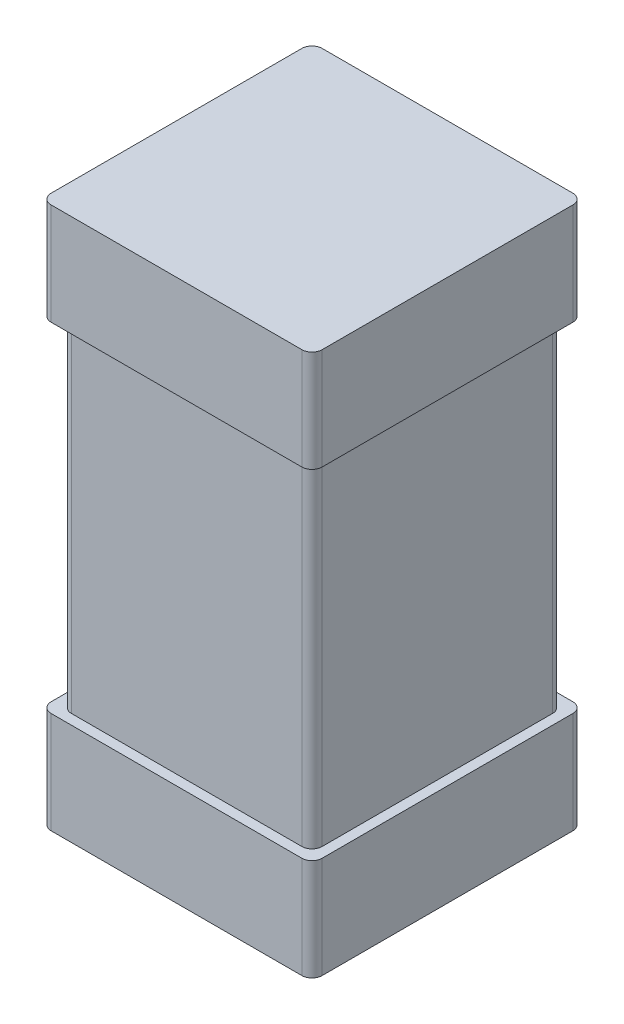
ISO-10303-21;
HEADER;
FILE_DESCRIPTION(('STEP AP214'),'2;1');
FILE_NAME('part.step','',(''),(''),'','','');
FILE_SCHEMA(('AUTOMOTIVE_DESIGN { 1 0 10303 214 1 1 1 1 }'));
ENDSEC;
DATA;
#1=APPLICATION_CONTEXT('core data for automotive mechanical design processes');
#2=APPLICATION_PROTOCOL_DEFINITION('international standard','automotive_design',2000,#1);
#3=PRODUCT_CONTEXT('',#1,'mechanical');
#4=PRODUCT('Part','Part','',(#3));
#5=PRODUCT_RELATED_PRODUCT_CATEGORY('part','',(#4));
#6=PRODUCT_DEFINITION_FORMATION('','',#4);
#7=PRODUCT_DEFINITION_CONTEXT('part definition',#1,'design');
#8=PRODUCT_DEFINITION('design','',#6,#7);
#9=PRODUCT_DEFINITION_SHAPE('','',#8);
#10=(LENGTH_UNIT() NAMED_UNIT(*) SI_UNIT(.MILLI.,.METRE.));
#11=(NAMED_UNIT(*) PLANE_ANGLE_UNIT() SI_UNIT($,.RADIAN.));
#12=(NAMED_UNIT(*) SI_UNIT($,.STERADIAN.) SOLID_ANGLE_UNIT());
#13=UNCERTAINTY_MEASURE_WITH_UNIT(LENGTH_MEASURE(1.E-05),#10,'distance_accuracy_value','');
#14=(GEOMETRIC_REPRESENTATION_CONTEXT(3) GLOBAL_UNCERTAINTY_ASSIGNED_CONTEXT((#13)) GLOBAL_UNIT_ASSIGNED_CONTEXT((#10,
#11,#12)) REPRESENTATION_CONTEXT('',''));
#15=CARTESIAN_POINT('',(0.,0.,0.));
#16=DIRECTION('',(0.,0.,1.));
#17=DIRECTION('',(1.,0.,0.));
#18=AXIS2_PLACEMENT_3D('',#15,#16,#17);
#19=CARTESIAN_POINT('',(139.070744279938,97.6120432923501,142.211582908599));
#20=DIRECTION('',(0.,1.,0.));
#21=DIRECTION('',(1.,0.,0.));
#22=AXIS2_PLACEMENT_3D('',#19,#20,#21);
#23=PLANE('',#22);
#24=DIRECTION('',(0.,0.,1.));
#25=VECTOR('',#24,1.);
#26=CARTESIAN_POINT('',(139.070744279938,97.6120432923501,142.211582908599));
#27=LINE('',#26,#25);
#28=CARTESIAN_POINT('',(139.070744279938,97.6120432923501,142.241582908599));
#29=VERTEX_POINT('',#28);
#30=CARTESIAN_POINT('',(139.070744279938,97.6120432923501,142.981582908599));
#31=VERTEX_POINT('',#30);
#32=EDGE_CURVE('E67',#29,#31,#27,.T.);
#33=ORIENTED_EDGE('',*,*,#32,.F.);
#34=CARTESIAN_POINT('',(139.040744279938,97.6120432923501,142.241582908599));
#35=DIRECTION('',(0.,1.,0.));
#36=DIRECTION('',(0.,0.,1.));
#37=AXIS2_PLACEMENT_3D('',#34,#35,#36);
#38=CIRCLE('',#37,0.0300000000000023);
#39=CARTESIAN_POINT('',(139.040744279938,97.6120432923501,142.211582908599));
#40=VERTEX_POINT('',#39);
#41=EDGE_CURVE('E11',#29,#40,#38,.T.);
#42=ORIENTED_EDGE('',*,*,#41,.T.);
#43=DIRECTION('',(-1.,0.,0.));
#44=VECTOR('',#43,1.);
#45=CARTESIAN_POINT('',(139.070744279938,97.6120432923501,142.211582908599));
#46=LINE('',#45,#44);
#47=CARTESIAN_POINT('',(138.300744279938,97.6120432923501,142.211582908599));
#48=VERTEX_POINT('',#47);
#49=EDGE_CURVE('E55',#40,#48,#46,.T.);
#50=ORIENTED_EDGE('',*,*,#49,.T.);
#51=CARTESIAN_POINT('',(138.300744279938,97.6120432923501,142.241582908599));
#52=DIRECTION('',(0.,-1.,0.));
#53=DIRECTION('',(0.,0.,1.));
#54=AXIS2_PLACEMENT_3D('',#51,#52,#53);
#55=CIRCLE('',#54,0.0300000000000023);
#56=CARTESIAN_POINT('',(138.270744279938,97.6120432923501,142.241582908599));
#57=VERTEX_POINT('',#56);
#58=EDGE_CURVE('E346',#57,#48,#55,.T.);
#59=ORIENTED_EDGE('',*,*,#58,.F.);
#60=DIRECTION('',(0.,0.,1.));
#61=VECTOR('',#60,1.);
#62=CARTESIAN_POINT('',(138.270744279938,97.6120432923501,142.211582908599));
#63=LINE('',#62,#61);
#64=CARTESIAN_POINT('',(138.270744279938,97.6120432923501,142.981582908599));
#65=VERTEX_POINT('',#64);
#66=EDGE_CURVE('E280',#57,#65,#63,.T.);
#67=ORIENTED_EDGE('',*,*,#66,.T.);
#68=CARTESIAN_POINT('',(138.300744279938,97.6120432923501,142.981582908599));
#69=DIRECTION('',(0.,1.,0.));
#70=DIRECTION('',(0.,0.,1.));
#71=AXIS2_PLACEMENT_3D('',#68,#69,#70);
#72=CIRCLE('',#71,0.0300000000000023);
#73=CARTESIAN_POINT('',(138.300744279938,97.6120432923501,143.011582908599));
#74=VERTEX_POINT('',#73);
#75=EDGE_CURVE('E302',#65,#74,#72,.T.);
#76=ORIENTED_EDGE('',*,*,#75,.T.);
#77=DIRECTION('',(-1.,0.,0.));
#78=VECTOR('',#77,1.);
#79=CARTESIAN_POINT('',(139.070744279938,97.6120432923501,143.011582908599));
#80=LINE('',#79,#78);
#81=CARTESIAN_POINT('',(139.040744279938,97.6120432923501,143.011582908599));
#82=VERTEX_POINT('',#81);
#83=EDGE_CURVE('E238',#82,#74,#80,.T.);
#84=ORIENTED_EDGE('',*,*,#83,.F.);
#85=CARTESIAN_POINT('',(139.040744279938,97.6120432923501,142.981582908599));
#86=DIRECTION('',(0.,-1.,0.));
#87=DIRECTION('',(0.,0.,1.));
#88=AXIS2_PLACEMENT_3D('',#85,#86,#87);
#89=CIRCLE('',#88,0.0300000000000023);
#90=EDGE_CURVE('E259',#31,#82,#89,.T.);
#91=ORIENTED_EDGE('',*,*,#90,.F.);
#92=EDGE_LOOP('',(#33,#42,#50,#59,#67,#76,#84,#91));
#93=FACE_BOUND('',#92,.T.);
#94=ADVANCED_FACE('F44',(#93),#23,.T.);
#95=CARTESIAN_POINT('',(138.270744279938,97.3120432923501,142.211582908599));
#96=DIRECTION('',(-1.,0.,0.));
#97=DIRECTION('',(0.,0.,1.));
#98=AXIS2_PLACEMENT_3D('',#95,#96,#97);
#99=PLANE('',#98);
#100=ORIENTED_EDGE('',*,*,#66,.F.);
#101=DIRECTION('',(0.,1.,0.));
#102=VECTOR('',#101,1.);
#103=CARTESIAN_POINT('',(138.270744279938,97.3120432923501,142.241582908599));
#104=LINE('',#103,#102);
#105=CARTESIAN_POINT('',(138.270744279938,97.3120432923501,142.241582908599));
#106=VERTEX_POINT('',#105);
#107=EDGE_CURVE('E231',#106,#57,#104,.T.);
#108=ORIENTED_EDGE('',*,*,#107,.F.);
#109=DIRECTION('',(0.,0.,1.));
#110=VECTOR('',#109,1.);
#111=CARTESIAN_POINT('',(138.270744279938,97.3120432923501,142.211582908599));
#112=LINE('',#111,#110);
#113=CARTESIAN_POINT('',(138.270744279938,97.3120432923501,142.981582908599));
#114=VERTEX_POINT('',#113);
#115=EDGE_CURVE('E306',#106,#114,#112,.T.);
#116=ORIENTED_EDGE('',*,*,#115,.T.);
#117=DIRECTION('',(0.,1.,0.));
#118=VECTOR('',#117,1.);
#119=CARTESIAN_POINT('',(138.270744279938,97.3120432923501,142.981582908599));
#120=LINE('',#119,#118);
#121=EDGE_CURVE('E285',#114,#65,#120,.T.);
#122=ORIENTED_EDGE('',*,*,#121,.T.);
#123=EDGE_LOOP('',(#100,#108,#116,#122));
#124=FACE_BOUND('',#123,.T.);
#125=ADVANCED_FACE('F618',(#124),#99,.T.);
#126=CARTESIAN_POINT('',(138.300744279938,97.3120432923501,142.981582908599));
#127=DIRECTION('',(0.,1.,0.));
#128=DIRECTION('',(-1.,0.,0.));
#129=AXIS2_PLACEMENT_3D('',#126,#127,#128);
#130=CYLINDRICAL_SURFACE('',#129,0.0300000000000023);
#131=CARTESIAN_POINT('',(138.300744279938,97.3120432923501,142.981582908599));
#132=DIRECTION('',(0.,1.,0.));
#133=DIRECTION('',(0.,0.,1.));
#134=AXIS2_PLACEMENT_3D('',#131,#132,#133);
#135=CIRCLE('',#134,0.0300000000000023);
#136=CARTESIAN_POINT('',(138.300744279938,97.3120432923501,143.011582908599));
#137=VERTEX_POINT('',#136);
#138=EDGE_CURVE('E281',#114,#137,#135,.T.);
#139=ORIENTED_EDGE('',*,*,#138,.T.);
#140=DIRECTION('',(0.,1.,0.));
#141=VECTOR('',#140,1.);
#142=CARTESIAN_POINT('',(138.300744279938,97.3120432923501,143.011582908599));
#143=LINE('',#142,#141);
#144=EDGE_CURVE('E286',#137,#74,#143,.T.);
#145=ORIENTED_EDGE('',*,*,#144,.T.);
#146=ORIENTED_EDGE('',*,*,#75,.F.);
#147=ORIENTED_EDGE('',*,*,#121,.F.);
#148=EDGE_LOOP('',(#139,#145,#146,#147));
#149=FACE_BOUND('',#148,.T.);
#150=ADVANCED_FACE('F533',(#149),#130,.T.);
#151=CARTESIAN_POINT('',(138.300744279938,97.3120432923501,142.241582908599));
#152=DIRECTION('',(0.,1.,0.));
#153=DIRECTION('',(-1.,0.,0.));
#154=AXIS2_PLACEMENT_3D('',#151,#152,#153);
#155=CYLINDRICAL_SURFACE('',#154,0.0300000000000023);
#156=ORIENTED_EDGE('',*,*,#107,.T.);
#157=ORIENTED_EDGE('',*,*,#58,.T.);
#158=DIRECTION('',(0.,1.,0.));
#159=VECTOR('',#158,1.);
#160=CARTESIAN_POINT('',(138.300744279938,97.3120432923501,142.211582908599));
#161=LINE('',#160,#159);
#162=CARTESIAN_POINT('',(138.300744279938,97.3120432923501,142.211582908599));
#163=VERTEX_POINT('',#162);
#164=EDGE_CURVE('E243',#163,#48,#161,.T.);
#165=ORIENTED_EDGE('',*,*,#164,.F.);
#166=CARTESIAN_POINT('',(138.300744279938,97.3120432923501,142.241582908599));
#167=DIRECTION('',(0.,-1.,0.));
#168=DIRECTION('',(0.,0.,1.));
#169=AXIS2_PLACEMENT_3D('',#166,#167,#168);
#170=CIRCLE('',#169,0.0300000000000023);
#171=EDGE_CURVE('E265',#106,#163,#170,.T.);
#172=ORIENTED_EDGE('',*,*,#171,.F.);
#173=EDGE_LOOP('',(#156,#157,#165,#172));
#174=FACE_BOUND('',#173,.T.);
#175=ADVANCED_FACE('F648',(#174),#155,.T.);
#176=CARTESIAN_POINT('',(139.070744279938,97.3120432923501,143.011582908599));
#177=DIRECTION('',(0.,0.,1.));
#178=DIRECTION('',(1.,0.,0.));
#179=AXIS2_PLACEMENT_3D('',#176,#177,#178);
#180=PLANE('',#179);
#181=DIRECTION('',(-1.,0.,0.));
#182=VECTOR('',#181,1.);
#183=CARTESIAN_POINT('',(139.070744279938,97.3120432923501,143.011582908599));
#184=LINE('',#183,#182);
#185=CARTESIAN_POINT('',(139.040744279938,97.3120432923501,143.011582908599));
#186=VERTEX_POINT('',#185);
#187=EDGE_CURVE('E260',#186,#137,#184,.T.);
#188=ORIENTED_EDGE('',*,*,#187,.F.);
#189=DIRECTION('',(0.,1.,0.));
#190=VECTOR('',#189,1.);
#191=CARTESIAN_POINT('',(139.040744279938,97.3120432923501,143.011582908599));
#192=LINE('',#191,#190);
#193=EDGE_CURVE('E242',#186,#82,#192,.T.);
#194=ORIENTED_EDGE('',*,*,#193,.T.);
#195=ORIENTED_EDGE('',*,*,#83,.T.);
#196=ORIENTED_EDGE('',*,*,#144,.F.);
#197=EDGE_LOOP('',(#188,#194,#195,#196));
#198=FACE_BOUND('',#197,.T.);
#199=ADVANCED_FACE('F528',(#198),#180,.T.);
#200=CARTESIAN_POINT('',(139.070744279938,97.3120432923501,142.211582908599));
#201=DIRECTION('',(0.,0.,1.));
#202=DIRECTION('',(1.,0.,0.));
#203=AXIS2_PLACEMENT_3D('',#200,#201,#202);
#204=PLANE('',#203);
#205=ORIENTED_EDGE('',*,*,#164,.T.);
#206=ORIENTED_EDGE('',*,*,#49,.F.);
#207=DIRECTION('',(0.,1.,0.));
#208=VECTOR('',#207,1.);
#209=CARTESIAN_POINT('',(139.040744279938,97.3120432923501,142.211582908599));
#210=LINE('',#209,#208);
#211=CARTESIAN_POINT('',(139.040744279938,97.3120432923501,142.211582908599));
#212=VERTEX_POINT('',#211);
#213=EDGE_CURVE('E326',#212,#40,#210,.T.);
#214=ORIENTED_EDGE('',*,*,#213,.F.);
#215=DIRECTION('',(-1.,0.,0.));
#216=VECTOR('',#215,1.);
#217=CARTESIAN_POINT('',(139.070744279938,97.3120432923501,142.211582908599));
#218=LINE('',#217,#216);
#219=EDGE_CURVE('E258',#212,#163,#218,.T.);
#220=ORIENTED_EDGE('',*,*,#219,.T.);
#221=EDGE_LOOP('',(#205,#206,#214,#220));
#222=FACE_BOUND('',#221,.T.);
#223=ADVANCED_FACE('F592',(#222),#204,.F.);
#224=CARTESIAN_POINT('',(139.040744279938,97.3120432923501,142.981582908599));
#225=DIRECTION('',(0.,1.,0.));
#226=DIRECTION('',(1.,0.,0.));
#227=AXIS2_PLACEMENT_3D('',#224,#225,#226);
#228=CYLINDRICAL_SURFACE('',#227,0.0300000000000023);
#229=DIRECTION('',(0.,1.,0.));
#230=VECTOR('',#229,1.);
#231=CARTESIAN_POINT('',(139.070744279938,97.3120432923501,142.981582908599));
#232=LINE('',#231,#230);
#233=CARTESIAN_POINT('',(139.070744279938,97.3120432923501,142.981582908599));
#234=VERTEX_POINT('',#233);
#235=EDGE_CURVE('E254',#234,#31,#232,.T.);
#236=ORIENTED_EDGE('',*,*,#235,.T.);
#237=ORIENTED_EDGE('',*,*,#90,.T.);
#238=ORIENTED_EDGE('',*,*,#193,.F.);
#239=CARTESIAN_POINT('',(139.040744279938,97.3120432923501,142.981582908599));
#240=DIRECTION('',(0.,-1.,0.));
#241=DIRECTION('',(0.,0.,1.));
#242=AXIS2_PLACEMENT_3D('',#239,#240,#241);
#243=CIRCLE('',#242,0.0300000000000023);
#244=EDGE_CURVE('E264',#234,#186,#243,.T.);
#245=ORIENTED_EDGE('',*,*,#244,.F.);
#246=EDGE_LOOP('',(#236,#237,#238,#245));
#247=FACE_BOUND('',#246,.T.);
#248=ADVANCED_FACE('F540',(#247),#228,.T.);
#249=CARTESIAN_POINT('',(139.040744279938,97.3120432923501,142.241582908599));
#250=DIRECTION('',(0.,1.,0.));
#251=DIRECTION('',(1.,0.,0.));
#252=AXIS2_PLACEMENT_3D('',#249,#250,#251);
#253=CYLINDRICAL_SURFACE('',#252,0.0300000000000023);
#254=CARTESIAN_POINT('',(139.040744279938,97.3120432923501,142.241582908599));
#255=DIRECTION('',(0.,1.,0.));
#256=DIRECTION('',(0.,0.,1.));
#257=AXIS2_PLACEMENT_3D('',#254,#255,#256);
#258=CIRCLE('',#257,0.0300000000000023);
#259=CARTESIAN_POINT('',(139.070744279938,97.3120432923501,142.241582908599));
#260=VERTEX_POINT('',#259);
#261=EDGE_CURVE('E385',#260,#212,#258,.T.);
#262=ORIENTED_EDGE('',*,*,#261,.T.);
#263=ORIENTED_EDGE('',*,*,#213,.T.);
#264=ORIENTED_EDGE('',*,*,#41,.F.);
#265=DIRECTION('',(0.,1.,0.));
#266=VECTOR('',#265,1.);
#267=CARTESIAN_POINT('',(139.070744279938,97.3120432923501,142.241582908599));
#268=LINE('',#267,#266);
#269=EDGE_CURVE('E322',#260,#29,#268,.T.);
#270=ORIENTED_EDGE('',*,*,#269,.F.);
#271=EDGE_LOOP('',(#262,#263,#264,#270));
#272=FACE_BOUND('',#271,.T.);
#273=ADVANCED_FACE('F548',(#272),#253,.T.);
#274=CARTESIAN_POINT('',(139.070744279938,97.3120432923501,142.211582908599));
#275=DIRECTION('',(-1.,0.,0.));
#276=DIRECTION('',(0.,0.,1.));
#277=AXIS2_PLACEMENT_3D('',#274,#275,#276);
#278=PLANE('',#277);
#279=ORIENTED_EDGE('',*,*,#235,.F.);
#280=DIRECTION('',(0.,0.,1.));
#281=VECTOR('',#280,1.);
#282=CARTESIAN_POINT('',(139.070744279938,97.3120432923501,142.211582908599));
#283=LINE('',#282,#281);
#284=EDGE_CURVE('E300',#260,#234,#283,.T.);
#285=ORIENTED_EDGE('',*,*,#284,.F.);
#286=ORIENTED_EDGE('',*,*,#269,.T.);
#287=ORIENTED_EDGE('',*,*,#32,.T.);
#288=EDGE_LOOP('',(#279,#285,#286,#287));
#289=FACE_BOUND('',#288,.T.);
#290=ADVANCED_FACE('F544',(#289),#278,.F.);
#291=CARTESIAN_POINT('',(139.070744279938,97.3120432923501,142.211582908599));
#292=DIRECTION('',(0.,1.,0.));
#293=DIRECTION('',(1.,0.,0.));
#294=AXIS2_PLACEMENT_3D('',#291,#292,#293);
#295=PLANE('',#294);
#296=ORIENTED_EDGE('',*,*,#244,.T.);
#297=ORIENTED_EDGE('',*,*,#187,.T.);
#298=ORIENTED_EDGE('',*,*,#138,.F.);
#299=ORIENTED_EDGE('',*,*,#115,.F.);
#300=ORIENTED_EDGE('',*,*,#171,.T.);
#301=ORIENTED_EDGE('',*,*,#219,.F.);
#302=ORIENTED_EDGE('',*,*,#261,.F.);
#303=ORIENTED_EDGE('',*,*,#284,.T.);
#304=EDGE_LOOP('',(#296,#297,#298,#299,#300,#301,#302,#303));
#305=FACE_BOUND('',#304,.T.);
#306=DIRECTION('',(-1.,0.,0.));
#307=VECTOR('',#306,1.);
#308=CARTESIAN_POINT('',(139.040744279938,97.3120432923501,142.241582908599));
#309=LINE('',#308,#307);
#310=CARTESIAN_POINT('',(139.010744279938,97.3120432923501,142.241582908599));
#311=VERTEX_POINT('',#310);
#312=CARTESIAN_POINT('',(138.330744279938,97.3120432923501,142.241582908599));
#313=VERTEX_POINT('',#312);
#314=EDGE_CURVE('E296',#311,#313,#309,.T.);
#315=ORIENTED_EDGE('',*,*,#314,.T.);
#316=CARTESIAN_POINT('',(138.330744279938,97.3120432923501,142.271582908599));
#317=DIRECTION('',(0.,-1.,0.));
#318=DIRECTION('',(0.,0.,1.));
#319=AXIS2_PLACEMENT_3D('',#316,#317,#318);
#320=CIRCLE('',#319,0.0300000000000023);
#321=CARTESIAN_POINT('',(138.300744279938,97.3120432923501,142.271582908599));
#322=VERTEX_POINT('',#321);
#323=EDGE_CURVE('E244',#322,#313,#320,.T.);
#324=ORIENTED_EDGE('',*,*,#323,.F.);
#325=DIRECTION('',(0.,0.,1.));
#326=VECTOR('',#325,1.);
#327=CARTESIAN_POINT('',(138.300744279938,97.3120432923501,142.241582908599));
#328=LINE('',#327,#326);
#329=CARTESIAN_POINT('',(138.300744279938,97.3120432923501,142.951582908599));
#330=VERTEX_POINT('',#329);
#331=EDGE_CURVE('E301',#322,#330,#328,.T.);
#332=ORIENTED_EDGE('',*,*,#331,.T.);
#333=CARTESIAN_POINT('',(138.330744279938,97.3120432923501,142.951582908599));
#334=DIRECTION('',(0.,1.,0.));
#335=DIRECTION('',(0.,0.,1.));
#336=AXIS2_PLACEMENT_3D('',#333,#334,#335);
#337=CIRCLE('',#336,0.0300000000000023);
#338=CARTESIAN_POINT('',(138.330744279938,97.3120432923501,142.981582908599));
#339=VERTEX_POINT('',#338);
#340=EDGE_CURVE('E370',#330,#339,#337,.T.);
#341=ORIENTED_EDGE('',*,*,#340,.T.);
#342=DIRECTION('',(-1.,0.,0.));
#343=VECTOR('',#342,1.);
#344=CARTESIAN_POINT('',(139.040744279938,97.3120432923501,142.981582908599));
#345=LINE('',#344,#343);
#346=CARTESIAN_POINT('',(139.010744279938,97.3120432923501,142.981582908599));
#347=VERTEX_POINT('',#346);
#348=EDGE_CURVE('E371',#347,#339,#345,.T.);
#349=ORIENTED_EDGE('',*,*,#348,.F.);
#350=CARTESIAN_POINT('',(139.010744279938,97.3120432923501,142.951582908599));
#351=DIRECTION('',(0.,-1.,0.));
#352=DIRECTION('',(0.,0.,1.));
#353=AXIS2_PLACEMENT_3D('',#350,#351,#352);
#354=CIRCLE('',#353,0.0300000000000023);
#355=CARTESIAN_POINT('',(139.040744279938,97.3120432923501,142.951582908599));
#356=VERTEX_POINT('',#355);
#357=EDGE_CURVE('E266',#356,#347,#354,.T.);
#358=ORIENTED_EDGE('',*,*,#357,.F.);
#359=DIRECTION('',(0.,0.,1.));
#360=VECTOR('',#359,1.);
#361=CARTESIAN_POINT('',(139.040744279938,97.3120432923501,142.241582908599));
#362=LINE('',#361,#360);
#363=CARTESIAN_POINT('',(139.040744279938,97.3120432923501,142.271582908599));
#364=VERTEX_POINT('',#363);
#365=EDGE_CURVE('E292',#364,#356,#362,.T.);
#366=ORIENTED_EDGE('',*,*,#365,.F.);
#367=CARTESIAN_POINT('',(139.010744279938,97.3120432923501,142.271582908599));
#368=DIRECTION('',(0.,1.,0.));
#369=DIRECTION('',(0.,0.,1.));
#370=AXIS2_PLACEMENT_3D('',#367,#368,#369);
#371=CIRCLE('',#370,0.0300000000000023);
#372=EDGE_CURVE('E291',#364,#311,#371,.T.);
#373=ORIENTED_EDGE('',*,*,#372,.T.);
#374=EDGE_LOOP('',(#315,#324,#332,#341,#349,#358,#366,#373));
#375=FACE_BOUND('',#374,.T.);
#376=ADVANCED_FACE('F537',(#305,#375),#295,.F.);
#377=CARTESIAN_POINT('',(139.040744279938,96.3120432923501,142.241582908599));
#378=DIRECTION('',(-1.,0.,0.));
#379=DIRECTION('',(0.,0.,1.));
#380=AXIS2_PLACEMENT_3D('',#377,#378,#379);
#381=PLANE('',#380);
#382=DIRECTION('',(0.,1.,0.));
#383=VECTOR('',#382,1.);
#384=CARTESIAN_POINT('',(139.040744279938,96.3120432923501,142.951582908599));
#385=LINE('',#384,#383);
#386=CARTESIAN_POINT('',(139.040744279938,96.3120432923501,142.951582908599));
#387=VERTEX_POINT('',#386);
#388=EDGE_CURVE('E269',#387,#356,#385,.T.);
#389=ORIENTED_EDGE('',*,*,#388,.F.);
#390=DIRECTION('',(0.,0.,1.));
#391=VECTOR('',#390,1.);
#392=CARTESIAN_POINT('',(139.040744279938,96.3120432923501,142.241582908599));
#393=LINE('',#392,#391);
#394=CARTESIAN_POINT('',(139.040744279938,96.3120432923501,142.271582908599));
#395=VERTEX_POINT('',#394);
#396=EDGE_CURVE('E307',#395,#387,#393,.T.);
#397=ORIENTED_EDGE('',*,*,#396,.F.);
#398=DIRECTION('',(0.,1.,0.));
#399=VECTOR('',#398,1.);
#400=CARTESIAN_POINT('',(139.040744279938,96.3120432923501,142.271582908599));
#401=LINE('',#400,#399);
#402=EDGE_CURVE('E287',#395,#364,#401,.T.);
#403=ORIENTED_EDGE('',*,*,#402,.T.);
#404=ORIENTED_EDGE('',*,*,#365,.T.);
#405=EDGE_LOOP('',(#389,#397,#403,#404));
#406=FACE_BOUND('',#405,.T.);
#407=ADVANCED_FACE('F569',(#406),#381,.F.);
#408=CARTESIAN_POINT('',(139.010744279938,96.3120432923501,142.951582908599));
#409=DIRECTION('',(0.,1.,0.));
#410=DIRECTION('',(1.,0.,0.));
#411=AXIS2_PLACEMENT_3D('',#408,#409,#410);
#412=CYLINDRICAL_SURFACE('',#411,0.0300000000000023);
#413=ORIENTED_EDGE('',*,*,#388,.T.);
#414=ORIENTED_EDGE('',*,*,#357,.T.);
#415=DIRECTION('',(0.,1.,0.));
#416=VECTOR('',#415,1.);
#417=CARTESIAN_POINT('',(139.010744279938,96.3120432923501,142.981582908599));
#418=LINE('',#417,#416);
#419=CARTESIAN_POINT('',(139.010744279938,96.3120432923501,142.981582908599));
#420=VERTEX_POINT('',#419);
#421=EDGE_CURVE('E270',#420,#347,#418,.T.);
#422=ORIENTED_EDGE('',*,*,#421,.F.);
#423=CARTESIAN_POINT('',(139.010744279938,96.3120432923501,142.951582908599));
#424=DIRECTION('',(0.,-1.,0.));
#425=DIRECTION('',(0.,0.,1.));
#426=AXIS2_PLACEMENT_3D('',#423,#424,#425);
#427=CIRCLE('',#426,0.0300000000000023);
#428=EDGE_CURVE('E312',#387,#420,#427,.T.);
#429=ORIENTED_EDGE('',*,*,#428,.F.);
#430=EDGE_LOOP('',(#413,#414,#422,#429));
#431=FACE_BOUND('',#430,.T.);
#432=ADVANCED_FACE('F704',(#431),#412,.T.);
#433=CARTESIAN_POINT('',(139.040744279938,96.3120432923501,142.981582908599));
#434=DIRECTION('',(0.,0.,1.));
#435=DIRECTION('',(1.,0.,0.));
#436=AXIS2_PLACEMENT_3D('',#433,#434,#435);
#437=PLANE('',#436);
#438=DIRECTION('',(-1.,0.,0.));
#439=VECTOR('',#438,1.);
#440=CARTESIAN_POINT('',(139.040744279938,96.3120432923501,142.981582908599));
#441=LINE('',#440,#439);
#442=CARTESIAN_POINT('',(138.330744279938,96.3120432923501,142.981582908599));
#443=VERTEX_POINT('',#442);
#444=EDGE_CURVE('E330',#420,#443,#441,.T.);
#445=ORIENTED_EDGE('',*,*,#444,.F.);
#446=ORIENTED_EDGE('',*,*,#421,.T.);
#447=ORIENTED_EDGE('',*,*,#348,.T.);
#448=DIRECTION('',(0.,1.,0.));
#449=VECTOR('',#448,1.);
#450=CARTESIAN_POINT('',(138.330744279938,96.3120432923501,142.981582908599));
#451=LINE('',#450,#449);
#452=EDGE_CURVE('E356',#443,#339,#451,.T.);
#453=ORIENTED_EDGE('',*,*,#452,.F.);
#454=EDGE_LOOP('',(#445,#446,#447,#453));
#455=FACE_BOUND('',#454,.T.);
#456=ADVANCED_FACE('F468',(#455),#437,.T.);
#457=CARTESIAN_POINT('',(138.330744279938,96.3120432923501,142.951582908599));
#458=DIRECTION('',(0.,1.,0.));
#459=DIRECTION('',(-1.,0.,0.));
#460=AXIS2_PLACEMENT_3D('',#457,#458,#459);
#461=CYLINDRICAL_SURFACE('',#460,0.0300000000000023);
#462=CARTESIAN_POINT('',(138.330744279938,96.3120432923501,142.951582908599));
#463=DIRECTION('',(0.,1.,0.));
#464=DIRECTION('',(0.,0.,1.));
#465=AXIS2_PLACEMENT_3D('',#462,#463,#464);
#466=CIRCLE('',#465,0.0300000000000023);
#467=CARTESIAN_POINT('',(138.300744279938,96.3120432923501,142.951582908599));
#468=VERTEX_POINT('',#467);
#469=EDGE_CURVE('E374',#468,#443,#466,.T.);
#470=ORIENTED_EDGE('',*,*,#469,.T.);
#471=ORIENTED_EDGE('',*,*,#452,.T.);
#472=ORIENTED_EDGE('',*,*,#340,.F.);
#473=DIRECTION('',(0.,1.,0.));
#474=VECTOR('',#473,1.);
#475=CARTESIAN_POINT('',(138.300744279938,96.3120432923501,142.951582908599));
#476=LINE('',#475,#474);
#477=EDGE_CURVE('E338',#468,#330,#476,.T.);
#478=ORIENTED_EDGE('',*,*,#477,.F.);
#479=EDGE_LOOP('',(#470,#471,#472,#478));
#480=FACE_BOUND('',#479,.T.);
#481=ADVANCED_FACE('F464',(#480),#461,.T.);
#482=CARTESIAN_POINT('',(138.300744279938,96.3120432923501,142.241582908599));
#483=DIRECTION('',(-1.,0.,0.));
#484=DIRECTION('',(0.,0.,1.));
#485=AXIS2_PLACEMENT_3D('',#482,#483,#484);
#486=PLANE('',#485);
#487=ORIENTED_EDGE('',*,*,#331,.F.);
#488=DIRECTION('',(0.,1.,0.));
#489=VECTOR('',#488,1.);
#490=CARTESIAN_POINT('',(138.300744279938,96.3120432923501,142.271582908599));
#491=LINE('',#490,#489);
#492=CARTESIAN_POINT('',(138.300744279938,96.3120432923501,142.271582908599));
#493=VERTEX_POINT('',#492);
#494=EDGE_CURVE('E248',#493,#322,#491,.T.);
#495=ORIENTED_EDGE('',*,*,#494,.F.);
#496=DIRECTION('',(0.,0.,1.));
#497=VECTOR('',#496,1.);
#498=CARTESIAN_POINT('',(138.300744279938,96.3120432923501,142.241582908599));
#499=LINE('',#498,#497);
#500=EDGE_CURVE('E342',#493,#468,#499,.T.);
#501=ORIENTED_EDGE('',*,*,#500,.T.);
#502=ORIENTED_EDGE('',*,*,#477,.T.);
#503=EDGE_LOOP('',(#487,#495,#501,#502));
#504=FACE_BOUND('',#503,.T.);
#505=ADVANCED_FACE('F583',(#504),#486,.T.);
#506=CARTESIAN_POINT('',(138.330744279938,96.3120432923501,142.271582908599));
#507=DIRECTION('',(0.,1.,0.));
#508=DIRECTION('',(-1.,0.,0.));
#509=AXIS2_PLACEMENT_3D('',#506,#507,#508);
#510=CYLINDRICAL_SURFACE('',#509,0.0300000000000023);
#511=ORIENTED_EDGE('',*,*,#494,.T.);
#512=ORIENTED_EDGE('',*,*,#323,.T.);
#513=DIRECTION('',(0.,1.,0.));
#514=VECTOR('',#513,1.);
#515=CARTESIAN_POINT('',(138.330744279938,96.3120432923501,142.241582908599));
#516=LINE('',#515,#514);
#517=CARTESIAN_POINT('',(138.330744279938,96.3120432923501,142.241582908599));
#518=VERTEX_POINT('',#517);
#519=EDGE_CURVE('E249',#518,#313,#516,.T.);
#520=ORIENTED_EDGE('',*,*,#519,.F.);
#521=CARTESIAN_POINT('',(138.330744279938,96.3120432923501,142.271582908599));
#522=DIRECTION('',(0.,-1.,0.));
#523=DIRECTION('',(0.,0.,1.));
#524=AXIS2_PLACEMENT_3D('',#521,#522,#523);
#525=CIRCLE('',#524,0.0300000000000023);
#526=EDGE_CURVE('E334',#493,#518,#525,.T.);
#527=ORIENTED_EDGE('',*,*,#526,.F.);
#528=EDGE_LOOP('',(#511,#512,#520,#527));
#529=FACE_BOUND('',#528,.T.);
#530=ADVANCED_FACE('F576',(#529),#510,.T.);
#531=CARTESIAN_POINT('',(139.040744279938,96.3120432923501,142.241582908599));
#532=DIRECTION('',(0.,0.,1.));
#533=DIRECTION('',(1.,0.,0.));
#534=AXIS2_PLACEMENT_3D('',#531,#532,#533);
#535=PLANE('',#534);
#536=ORIENTED_EDGE('',*,*,#519,.T.);
#537=ORIENTED_EDGE('',*,*,#314,.F.);
#538=DIRECTION('',(0.,1.,0.));
#539=VECTOR('',#538,1.);
#540=CARTESIAN_POINT('',(139.010744279938,96.3120432923501,142.241582908599));
#541=LINE('',#540,#539);
#542=CARTESIAN_POINT('',(139.010744279938,96.3120432923501,142.241582908599));
#543=VERTEX_POINT('',#542);
#544=EDGE_CURVE('E236',#543,#311,#541,.T.);
#545=ORIENTED_EDGE('',*,*,#544,.F.);
#546=DIRECTION('',(-1.,0.,0.));
#547=VECTOR('',#546,1.);
#548=CARTESIAN_POINT('',(139.040744279938,96.3120432923501,142.241582908599));
#549=LINE('',#548,#547);
#550=EDGE_CURVE('E250',#543,#518,#549,.T.);
#551=ORIENTED_EDGE('',*,*,#550,.T.);
#552=EDGE_LOOP('',(#536,#537,#545,#551));
#553=FACE_BOUND('',#552,.T.);
#554=ADVANCED_FACE('F582',(#553),#535,.F.);
#555=CARTESIAN_POINT('',(139.010744279938,96.3120432923501,142.271582908599));
#556=DIRECTION('',(0.,1.,0.));
#557=DIRECTION('',(1.,0.,0.));
#558=AXIS2_PLACEMENT_3D('',#555,#556,#557);
#559=CYLINDRICAL_SURFACE('',#558,0.0300000000000023);
#560=CARTESIAN_POINT('',(139.010744279938,96.3120432923501,142.271582908599));
#561=DIRECTION('',(0.,1.,0.));
#562=DIRECTION('',(0.,0.,1.));
#563=AXIS2_PLACEMENT_3D('',#560,#561,#562);
#564=CIRCLE('',#563,0.0300000000000023);
#565=EDGE_CURVE('E48',#395,#543,#564,.T.);
#566=ORIENTED_EDGE('',*,*,#565,.T.);
#567=ORIENTED_EDGE('',*,*,#544,.T.);
#568=ORIENTED_EDGE('',*,*,#372,.F.);
#569=ORIENTED_EDGE('',*,*,#402,.F.);
#570=EDGE_LOOP('',(#566,#567,#568,#569));
#571=FACE_BOUND('',#570,.T.);
#572=ADVANCED_FACE('F567',(#571),#559,.T.);
#573=CARTESIAN_POINT('',(139.070744279938,96.3120432923501,142.211582908599));
#574=DIRECTION('',(0.,1.,0.));
#575=DIRECTION('',(1.,0.,0.));
#576=AXIS2_PLACEMENT_3D('',#573,#574,#575);
#577=PLANE('',#576);
#578=DIRECTION('',(0.,0.,1.));
#579=VECTOR('',#578,1.);
#580=CARTESIAN_POINT('',(139.070744279938,96.3120432923501,142.211582908599));
#581=LINE('',#580,#579);
#582=CARTESIAN_POINT('',(139.070744279938,96.3120432923501,142.241582908599));
#583=VERTEX_POINT('',#582);
#584=CARTESIAN_POINT('',(139.070744279938,96.3120432923501,142.981582908599));
#585=VERTEX_POINT('',#584);
#586=EDGE_CURVE('E151',#583,#585,#581,.T.);
#587=ORIENTED_EDGE('',*,*,#586,.F.);
#588=CARTESIAN_POINT('',(139.040744279938,96.3120432923501,142.241582908599));
#589=DIRECTION('',(0.,1.,0.));
#590=DIRECTION('',(0.,0.,1.));
#591=AXIS2_PLACEMENT_3D('',#588,#589,#590);
#592=CIRCLE('',#591,0.0300000000000023);
#593=CARTESIAN_POINT('',(139.040744279938,96.3120432923501,142.211582908599));
#594=VERTEX_POINT('',#593);
#595=EDGE_CURVE('E233',#583,#594,#592,.T.);
#596=ORIENTED_EDGE('',*,*,#595,.T.);
#597=DIRECTION('',(-1.,0.,0.));
#598=VECTOR('',#597,1.);
#599=CARTESIAN_POINT('',(139.070744279938,96.3120432923501,142.211582908599));
#600=LINE('',#599,#598);
#601=CARTESIAN_POINT('',(138.300744279938,96.3120432923501,142.211582908599));
#602=VERTEX_POINT('',#601);
#603=EDGE_CURVE('E237',#594,#602,#600,.T.);
#604=ORIENTED_EDGE('',*,*,#603,.T.);
#605=CARTESIAN_POINT('',(138.300744279938,96.3120432923501,142.241582908599));
#606=DIRECTION('',(0.,-1.,0.));
#607=DIRECTION('',(0.,0.,1.));
#608=AXIS2_PLACEMENT_3D('',#605,#606,#607);
#609=CIRCLE('',#608,0.0300000000000023);
#610=CARTESIAN_POINT('',(138.270744279938,96.3120432923501,142.241582908599));
#611=VERTEX_POINT('',#610);
#612=EDGE_CURVE('E274',#611,#602,#609,.T.);
#613=ORIENTED_EDGE('',*,*,#612,.F.);
#614=DIRECTION('',(0.,0.,1.));
#615=VECTOR('',#614,1.);
#616=CARTESIAN_POINT('',(138.270744279938,96.3120432923501,142.211582908599));
#617=LINE('',#616,#615);
#618=CARTESIAN_POINT('',(138.270744279938,96.3120432923501,142.981582908599));
#619=VERTEX_POINT('',#618);
#620=EDGE_CURVE('E360',#611,#619,#617,.T.);
#621=ORIENTED_EDGE('',*,*,#620,.T.);
#622=CARTESIAN_POINT('',(138.300744279938,96.3120432923501,142.981582908599));
#623=DIRECTION('',(0.,1.,0.));
#624=DIRECTION('',(0.,0.,1.));
#625=AXIS2_PLACEMENT_3D('',#622,#623,#624);
#626=CIRCLE('',#625,0.0300000000000023);
#627=CARTESIAN_POINT('',(138.300744279938,96.3120432923501,143.011582908599));
#628=VERTEX_POINT('',#627);
#629=EDGE_CURVE('E311',#619,#628,#626,.T.);
#630=ORIENTED_EDGE('',*,*,#629,.T.);
#631=DIRECTION('',(-1.,0.,0.));
#632=VECTOR('',#631,1.);
#633=CARTESIAN_POINT('',(139.070744279938,96.3120432923501,143.011582908599));
#634=LINE('',#633,#632);
#635=CARTESIAN_POINT('',(139.040744279938,96.3120432923501,143.011582908599));
#636=VERTEX_POINT('',#635);
#637=EDGE_CURVE('E426',#636,#628,#634,.T.);
#638=ORIENTED_EDGE('',*,*,#637,.F.);
#639=CARTESIAN_POINT('',(139.040744279938,96.3120432923501,142.981582908599));
#640=DIRECTION('',(0.,-1.,0.));
#641=DIRECTION('',(0.,0.,1.));
#642=AXIS2_PLACEMENT_3D('',#639,#640,#641);
#643=CIRCLE('',#642,0.0300000000000023);
#644=EDGE_CURVE('E213',#585,#636,#643,.T.);
#645=ORIENTED_EDGE('',*,*,#644,.F.);
#646=EDGE_LOOP('',(#587,#596,#604,#613,#621,#630,#638,#645));
#647=FACE_BOUND('',#646,.T.);
#648=ORIENTED_EDGE('',*,*,#565,.F.);
#649=ORIENTED_EDGE('',*,*,#396,.T.);
#650=ORIENTED_EDGE('',*,*,#428,.T.);
#651=ORIENTED_EDGE('',*,*,#444,.T.);
#652=ORIENTED_EDGE('',*,*,#469,.F.);
#653=ORIENTED_EDGE('',*,*,#500,.F.);
#654=ORIENTED_EDGE('',*,*,#526,.T.);
#655=ORIENTED_EDGE('',*,*,#550,.F.);
#656=EDGE_LOOP('',(#648,#649,#650,#651,#652,#653,#654,#655));
#657=FACE_BOUND('',#656,.T.);
#658=ADVANCED_FACE('F571',(#647,#657),#577,.T.);
#659=CARTESIAN_POINT('',(138.270744279938,96.0120432923501,142.211582908599));
#660=DIRECTION('',(-1.,0.,0.));
#661=DIRECTION('',(0.,0.,1.));
#662=AXIS2_PLACEMENT_3D('',#659,#660,#661);
#663=PLANE('',#662);
#664=ORIENTED_EDGE('',*,*,#620,.F.);
#665=DIRECTION('',(0.,1.,0.));
#666=VECTOR('',#665,1.);
#667=CARTESIAN_POINT('',(138.270744279938,96.0120432923501,142.241582908599));
#668=LINE('',#667,#666);
#669=CARTESIAN_POINT('',(138.270744279938,96.0120432923501,142.241582908599));
#670=VERTEX_POINT('',#669);
#671=EDGE_CURVE('E166',#670,#611,#668,.T.);
#672=ORIENTED_EDGE('',*,*,#671,.F.);
#673=DIRECTION('',(0.,0.,1.));
#674=VECTOR('',#673,1.);
#675=CARTESIAN_POINT('',(138.270744279938,96.0120432923501,142.211582908599));
#676=LINE('',#675,#674);
#677=CARTESIAN_POINT('',(138.270744279938,96.0120432923501,142.981582908599));
#678=VERTEX_POINT('',#677);
#679=EDGE_CURVE('E364',#670,#678,#676,.T.);
#680=ORIENTED_EDGE('',*,*,#679,.T.);
#681=DIRECTION('',(0.,1.,0.));
#682=VECTOR('',#681,1.);
#683=CARTESIAN_POINT('',(138.270744279938,96.0120432923501,142.981582908599));
#684=LINE('',#683,#682);
#685=EDGE_CURVE('E361',#678,#619,#684,.T.);
#686=ORIENTED_EDGE('',*,*,#685,.T.);
#687=EDGE_LOOP('',(#664,#672,#680,#686));
#688=FACE_BOUND('',#687,.T.);
#689=ADVANCED_FACE('F606',(#688),#663,.T.);
#690=CARTESIAN_POINT('',(138.300744279938,96.0120432923501,142.981582908599));
#691=DIRECTION('',(0.,1.,0.));
#692=DIRECTION('',(-1.,0.,0.));
#693=AXIS2_PLACEMENT_3D('',#690,#691,#692);
#694=CYLINDRICAL_SURFACE('',#693,0.0300000000000023);
#695=CARTESIAN_POINT('',(138.300744279938,96.0120432923501,142.981582908599));
#696=DIRECTION('',(0.,1.,0.));
#697=DIRECTION('',(0.,0.,1.));
#698=AXIS2_PLACEMENT_3D('',#695,#696,#697);
#699=CIRCLE('',#698,0.0300000000000023);
#700=CARTESIAN_POINT('',(138.300744279938,96.0120432923501,143.011582908599));
#701=VERTEX_POINT('',#700);
#702=EDGE_CURVE('E365',#678,#701,#699,.T.);
#703=ORIENTED_EDGE('',*,*,#702,.T.);
#704=DIRECTION('',(0.,1.,0.));
#705=VECTOR('',#704,1.);
#706=CARTESIAN_POINT('',(138.300744279938,96.0120432923501,143.011582908599));
#707=LINE('',#706,#705);
#708=EDGE_CURVE('E378',#701,#628,#707,.T.);
#709=ORIENTED_EDGE('',*,*,#708,.T.);
#710=ORIENTED_EDGE('',*,*,#629,.F.);
#711=ORIENTED_EDGE('',*,*,#685,.F.);
#712=EDGE_LOOP('',(#703,#709,#710,#711));
#713=FACE_BOUND('',#712,.T.);
#714=ADVANCED_FACE('F46',(#713),#694,.T.);
#715=CARTESIAN_POINT('',(138.300744279938,96.0120432923501,142.241582908599));
#716=DIRECTION('',(0.,1.,0.));
#717=DIRECTION('',(-1.,0.,0.));
#718=AXIS2_PLACEMENT_3D('',#715,#716,#717);
#719=CYLINDRICAL_SURFACE('',#718,0.0300000000000023);
#720=ORIENTED_EDGE('',*,*,#671,.T.);
#721=ORIENTED_EDGE('',*,*,#612,.T.);
#722=DIRECTION('',(0.,1.,0.));
#723=VECTOR('',#722,1.);
#724=CARTESIAN_POINT('',(138.300744279938,96.0120432923501,142.211582908599));
#725=LINE('',#724,#723);
#726=CARTESIAN_POINT('',(138.300744279938,96.0120432923501,142.211582908599));
#727=VERTEX_POINT('',#726);
#728=EDGE_CURVE('E389',#727,#602,#725,.T.);
#729=ORIENTED_EDGE('',*,*,#728,.F.);
#730=CARTESIAN_POINT('',(138.300744279938,96.0120432923501,142.241582908599));
#731=DIRECTION('',(0.,-1.,0.));
#732=DIRECTION('',(0.,0.,1.));
#733=AXIS2_PLACEMENT_3D('',#730,#731,#732);
#734=CIRCLE('',#733,0.0300000000000023);
#735=EDGE_CURVE('E221',#670,#727,#734,.T.);
#736=ORIENTED_EDGE('',*,*,#735,.F.);
#737=EDGE_LOOP('',(#720,#721,#729,#736));
#738=FACE_BOUND('',#737,.T.);
#739=ADVANCED_FACE('F810',(#738),#719,.T.);
#740=CARTESIAN_POINT('',(139.070744279938,96.0120432923501,143.011582908599));
#741=DIRECTION('',(0.,0.,1.));
#742=DIRECTION('',(1.,0.,0.));
#743=AXIS2_PLACEMENT_3D('',#740,#741,#742);
#744=PLANE('',#743);
#745=DIRECTION('',(-1.,0.,0.));
#746=VECTOR('',#745,1.);
#747=CARTESIAN_POINT('',(139.070744279938,96.0120432923501,143.011582908599));
#748=LINE('',#747,#746);
#749=CARTESIAN_POINT('',(139.040744279938,96.0120432923501,143.011582908599));
#750=VERTEX_POINT('',#749);
#751=EDGE_CURVE('E206',#750,#701,#748,.T.);
#752=ORIENTED_EDGE('',*,*,#751,.F.);
#753=DIRECTION('',(0.,1.,0.));
#754=VECTOR('',#753,1.);
#755=CARTESIAN_POINT('',(139.040744279938,96.0120432923501,143.011582908599));
#756=LINE('',#755,#754);
#757=EDGE_CURVE('E201',#750,#636,#756,.T.);
#758=ORIENTED_EDGE('',*,*,#757,.T.);
#759=ORIENTED_EDGE('',*,*,#637,.T.);
#760=ORIENTED_EDGE('',*,*,#708,.F.);
#761=EDGE_LOOP('',(#752,#758,#759,#760));
#762=FACE_BOUND('',#761,.T.);
#763=ADVANCED_FACE('F757',(#762),#744,.T.);
#764=CARTESIAN_POINT('',(139.070744279938,96.0120432923501,142.211582908599));
#765=DIRECTION('',(0.,0.,1.));
#766=DIRECTION('',(1.,0.,0.));
#767=AXIS2_PLACEMENT_3D('',#764,#765,#766);
#768=PLANE('',#767);
#769=ORIENTED_EDGE('',*,*,#728,.T.);
#770=ORIENTED_EDGE('',*,*,#603,.F.);
#771=DIRECTION('',(0.,1.,0.));
#772=VECTOR('',#771,1.);
#773=CARTESIAN_POINT('',(139.040744279938,96.0120432923501,142.211582908599));
#774=LINE('',#773,#772);
#775=CARTESIAN_POINT('',(139.040744279938,96.0120432923501,142.211582908599));
#776=VERTEX_POINT('',#775);
#777=EDGE_CURVE('E392',#776,#594,#774,.T.);
#778=ORIENTED_EDGE('',*,*,#777,.F.);
#779=DIRECTION('',(-1.,0.,0.));
#780=VECTOR('',#779,1.);
#781=CARTESIAN_POINT('',(139.070744279938,96.0120432923501,142.211582908599));
#782=LINE('',#781,#780);
#783=EDGE_CURVE('E212',#776,#727,#782,.T.);
#784=ORIENTED_EDGE('',*,*,#783,.T.);
#785=EDGE_LOOP('',(#769,#770,#778,#784));
#786=FACE_BOUND('',#785,.T.);
#787=ADVANCED_FACE('F640',(#786),#768,.F.);
#788=CARTESIAN_POINT('',(139.040744279938,96.0120432923501,142.981582908599));
#789=DIRECTION('',(0.,1.,0.));
#790=DIRECTION('',(1.,0.,0.));
#791=AXIS2_PLACEMENT_3D('',#788,#789,#790);
#792=CYLINDRICAL_SURFACE('',#791,0.0300000000000023);
#793=DIRECTION('',(0.,1.,0.));
#794=VECTOR('',#793,1.);
#795=CARTESIAN_POINT('',(139.070744279938,96.0120432923501,142.981582908599));
#796=LINE('',#795,#794);
#797=CARTESIAN_POINT('',(139.070744279938,96.0120432923501,142.981582908599));
#798=VERTEX_POINT('',#797);
#799=EDGE_CURVE('E199',#798,#585,#796,.T.);
#800=ORIENTED_EDGE('',*,*,#799,.T.);
#801=ORIENTED_EDGE('',*,*,#644,.T.);
#802=ORIENTED_EDGE('',*,*,#757,.F.);
#803=CARTESIAN_POINT('',(139.040744279938,96.0120432923501,142.981582908599));
#804=DIRECTION('',(0.,-1.,0.));
#805=DIRECTION('',(0.,0.,1.));
#806=AXIS2_PLACEMENT_3D('',#803,#804,#805);
#807=CIRCLE('',#806,0.0300000000000023);
#808=EDGE_CURVE('E197',#798,#750,#807,.T.);
#809=ORIENTED_EDGE('',*,*,#808,.F.);
#810=EDGE_LOOP('',(#800,#801,#802,#809));
#811=FACE_BOUND('',#810,.T.);
#812=ADVANCED_FACE('F198',(#811),#792,.T.);
#813=CARTESIAN_POINT('',(139.040744279938,96.0120432923501,142.241582908599));
#814=DIRECTION('',(0.,1.,0.));
#815=DIRECTION('',(1.,0.,0.));
#816=AXIS2_PLACEMENT_3D('',#813,#814,#815);
#817=CYLINDRICAL_SURFACE('',#816,0.0300000000000023);
#818=CARTESIAN_POINT('',(139.040744279938,96.0120432923501,142.241582908599));
#819=DIRECTION('',(0.,1.,0.));
#820=DIRECTION('',(0.,0.,1.));
#821=AXIS2_PLACEMENT_3D('',#818,#819,#820);
#822=CIRCLE('',#821,0.0300000000000023);
#823=CARTESIAN_POINT('',(139.070744279938,96.0120432923501,142.241582908599));
#824=VERTEX_POINT('',#823);
#825=EDGE_CURVE('E219',#824,#776,#822,.T.);
#826=ORIENTED_EDGE('',*,*,#825,.T.);
#827=ORIENTED_EDGE('',*,*,#777,.T.);
#828=ORIENTED_EDGE('',*,*,#595,.F.);
#829=DIRECTION('',(0.,1.,0.));
#830=VECTOR('',#829,1.);
#831=CARTESIAN_POINT('',(139.070744279938,96.0120432923501,142.241582908599));
#832=LINE('',#831,#830);
#833=EDGE_CURVE('E337',#824,#583,#832,.T.);
#834=ORIENTED_EDGE('',*,*,#833,.F.);
#835=EDGE_LOOP('',(#826,#827,#828,#834));
#836=FACE_BOUND('',#835,.T.);
#837=ADVANCED_FACE('F639',(#836),#817,.T.);
#838=CARTESIAN_POINT('',(139.070744279938,96.0120432923501,142.211582908599));
#839=DIRECTION('',(-1.,0.,0.));
#840=DIRECTION('',(0.,0.,1.));
#841=AXIS2_PLACEMENT_3D('',#838,#839,#840);
#842=PLANE('',#841);
#843=ORIENTED_EDGE('',*,*,#799,.F.);
#844=DIRECTION('',(0.,0.,1.));
#845=VECTOR('',#844,1.);
#846=CARTESIAN_POINT('',(139.070744279938,96.0120432923501,142.211582908599));
#847=LINE('',#846,#845);
#848=EDGE_CURVE('E210',#824,#798,#847,.T.);
#849=ORIENTED_EDGE('',*,*,#848,.F.);
#850=ORIENTED_EDGE('',*,*,#833,.T.);
#851=ORIENTED_EDGE('',*,*,#586,.T.);
#852=EDGE_LOOP('',(#843,#849,#850,#851));
#853=FACE_BOUND('',#852,.T.);
#854=ADVANCED_FACE('F209',(#853),#842,.F.);
#855=CARTESIAN_POINT('',(139.070744279938,96.0120432923501,142.211582908599));
#856=DIRECTION('',(0.,1.,0.));
#857=DIRECTION('',(1.,0.,0.));
#858=AXIS2_PLACEMENT_3D('',#855,#856,#857);
#859=PLANE('',#858);
#860=ORIENTED_EDGE('',*,*,#808,.T.);
#861=ORIENTED_EDGE('',*,*,#751,.T.);
#862=ORIENTED_EDGE('',*,*,#702,.F.);
#863=ORIENTED_EDGE('',*,*,#679,.F.);
#864=ORIENTED_EDGE('',*,*,#735,.T.);
#865=ORIENTED_EDGE('',*,*,#783,.F.);
#866=ORIENTED_EDGE('',*,*,#825,.F.);
#867=ORIENTED_EDGE('',*,*,#848,.T.);
#868=EDGE_LOOP('',(#860,#861,#862,#863,#864,#865,#866,#867));
#869=FACE_BOUND('',#868,.T.);
#870=ADVANCED_FACE('F216',(#869),#859,.F.);
#871=CLOSED_SHELL('',(#94,#125,#150,#175,#199,#223,#248,#273,#290,#376,#407,#432,#456,#481,#505,
#530,#554,#572,#658,#689,#714,#739,#763,#787,#812,#837,#854,#870));
#872=MANIFOLD_SOLID_BREP('B2',#871);
#873=ADVANCED_BREP_SHAPE_REPRESENTATION('',(#18,#872),#14);
#874=SHAPE_DEFINITION_REPRESENTATION(#9,#873);
ENDSEC;
END-ISO-10303-21;
